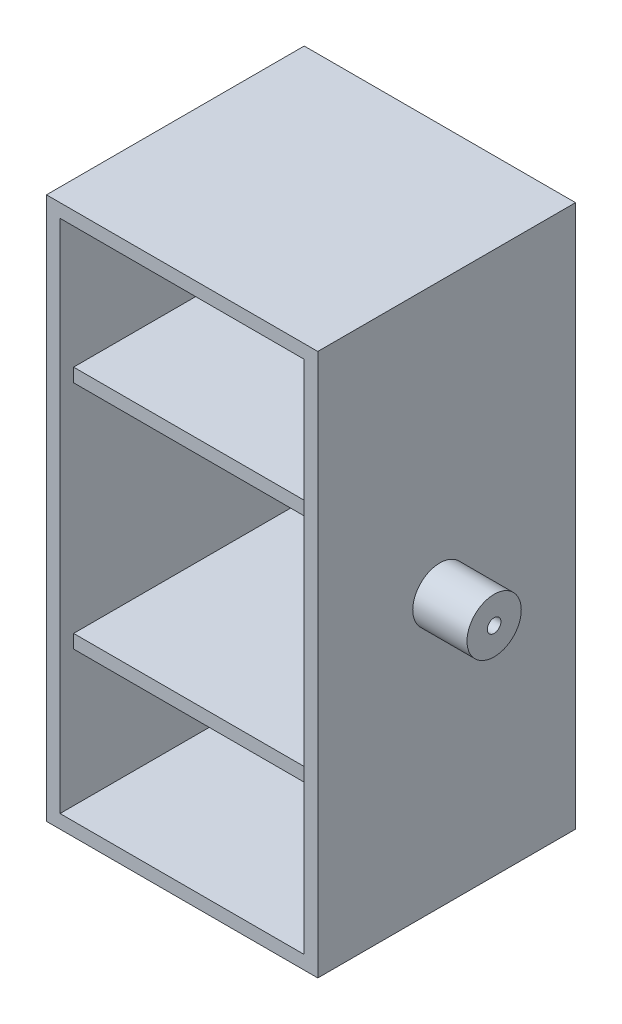
ISO-10303-21;
HEADER;
FILE_DESCRIPTION(('STEP AP214'),'2;1');
FILE_NAME('part.step','',(''),(''),'','','');
FILE_SCHEMA(('AUTOMOTIVE_DESIGN { 1 0 10303 214 1 1 1 1 }'));
ENDSEC;
DATA;
#1=APPLICATION_CONTEXT('core data for automotive mechanical design processes');
#2=APPLICATION_PROTOCOL_DEFINITION('international standard','automotive_design',2000,#1);
#3=PRODUCT_CONTEXT('',#1,'mechanical');
#4=PRODUCT('Part','Part','',(#3));
#5=PRODUCT_RELATED_PRODUCT_CATEGORY('part','',(#4));
#6=PRODUCT_DEFINITION_FORMATION('','',#4);
#7=PRODUCT_DEFINITION_CONTEXT('part definition',#1,'design');
#8=PRODUCT_DEFINITION('design','',#6,#7);
#9=PRODUCT_DEFINITION_SHAPE('','',#8);
#10=(LENGTH_UNIT() NAMED_UNIT(*) SI_UNIT(.MILLI.,.METRE.));
#11=(NAMED_UNIT(*) PLANE_ANGLE_UNIT() SI_UNIT($,.RADIAN.));
#12=(NAMED_UNIT(*) SI_UNIT($,.STERADIAN.) SOLID_ANGLE_UNIT());
#13=UNCERTAINTY_MEASURE_WITH_UNIT(LENGTH_MEASURE(1.E-05),#10,'distance_accuracy_value','');
#14=(GEOMETRIC_REPRESENTATION_CONTEXT(3) GLOBAL_UNCERTAINTY_ASSIGNED_CONTEXT((#13)) GLOBAL_UNIT_ASSIGNED_CONTEXT((#10,
#11,#12)) REPRESENTATION_CONTEXT('',''));
#15=CARTESIAN_POINT('',(0.,0.,0.));
#16=DIRECTION('',(0.,0.,1.));
#17=DIRECTION('',(1.,0.,0.));
#18=AXIS2_PLACEMENT_3D('',#15,#16,#17);
#19=CARTESIAN_POINT('',(0.,200.,0.));
#20=DIRECTION('',(1.,0.,0.));
#21=DIRECTION('',(0.,0.,-1.));
#22=AXIS2_PLACEMENT_3D('',#19,#20,#21);
#23=PLANE('',#22);
#24=CARTESIAN_POINT('',(0.,100.,50.));
#25=DIRECTION('',(1.,0.,0.));
#26=DIRECTION('',(0.,0.,-1.));
#27=AXIS2_PLACEMENT_3D('',#24,#25,#26);
#28=CIRCLE('',#27,10.);
#29=CARTESIAN_POINT('',(0.,100.,40.));
#30=VERTEX_POINT('',#29);
#31=EDGE_CURVE('E11',#30,#30,#28,.F.);
#32=ORIENTED_EDGE('',*,*,#31,.F.);
#33=EDGE_LOOP('',(#32));
#34=FACE_BOUND('',#33,.T.);
#35=DIRECTION('',(0.,-1.,0.));
#36=VECTOR('',#35,1.);
#37=CARTESIAN_POINT('',(0.,0.,95.));
#38=LINE('',#37,#36);
#39=CARTESIAN_POINT('',(0.,200.,95.));
#40=VERTEX_POINT('',#39);
#41=CARTESIAN_POINT('',(0.,0.,95.));
#42=VERTEX_POINT('',#41);
#43=EDGE_CURVE('E56',#40,#42,#38,.T.);
#44=ORIENTED_EDGE('',*,*,#43,.F.);
#45=DIRECTION('',(0.,0.,1.));
#46=VECTOR('',#45,1.);
#47=CARTESIAN_POINT('',(0.,200.,0.));
#48=LINE('',#47,#46);
#49=CARTESIAN_POINT('',(0.,200.,0.));
#50=VERTEX_POINT('',#49);
#51=EDGE_CURVE('E180',#50,#40,#48,.T.);
#52=ORIENTED_EDGE('',*,*,#51,.F.);
#53=DIRECTION('',(0.,-1.,0.));
#54=VECTOR('',#53,1.);
#55=CARTESIAN_POINT('',(0.,200.,0.));
#56=LINE('',#55,#54);
#57=CARTESIAN_POINT('',(0.,0.,0.));
#58=VERTEX_POINT('',#57);
#59=EDGE_CURVE('E186',#50,#58,#56,.T.);
#60=ORIENTED_EDGE('',*,*,#59,.T.);
#61=DIRECTION('',(0.,0.,1.));
#62=VECTOR('',#61,1.);
#63=CARTESIAN_POINT('',(0.,0.,0.));
#64=LINE('',#63,#62);
#65=EDGE_CURVE('E176',#58,#42,#64,.T.);
#66=ORIENTED_EDGE('',*,*,#65,.T.);
#67=EDGE_LOOP('',(#44,#52,#60,#66));
#68=FACE_BOUND('',#67,.T.);
#69=ADVANCED_FACE('F41',(#34,#68),#23,.F.);
#70=CARTESIAN_POINT('',(100.,200.,0.));
#71=DIRECTION('',(-1.,0.,0.));
#72=DIRECTION('',(0.,0.,1.));
#73=AXIS2_PLACEMENT_3D('',#70,#71,#72);
#74=PLANE('',#73);
#75=CARTESIAN_POINT('',(100.,100.,50.0000000000057));
#76=DIRECTION('',(-1.,0.,0.));
#77=DIRECTION('',(0.,0.,1.));
#78=AXIS2_PLACEMENT_3D('',#75,#76,#77);
#79=CIRCLE('',#78,10.);
#80=CARTESIAN_POINT('',(100.,100.,60.0000000000057));
#81=VERTEX_POINT('',#80);
#82=EDGE_CURVE('E49',#81,#81,#79,.F.);
#83=ORIENTED_EDGE('',*,*,#82,.F.);
#84=EDGE_LOOP('',(#83));
#85=FACE_BOUND('',#84,.T.);
#86=DIRECTION('',(0.,1.,0.));
#87=VECTOR('',#86,1.);
#88=CARTESIAN_POINT('',(100.,0.,95.));
#89=LINE('',#88,#87);
#90=CARTESIAN_POINT('',(100.,0.,95.));
#91=VERTEX_POINT('',#90);
#92=CARTESIAN_POINT('',(100.,200.,95.));
#93=VERTEX_POINT('',#92);
#94=EDGE_CURVE('E154',#91,#93,#89,.T.);
#95=ORIENTED_EDGE('',*,*,#94,.F.);
#96=DIRECTION('',(0.,0.,-1.));
#97=VECTOR('',#96,1.);
#98=CARTESIAN_POINT('',(100.,0.,0.));
#99=LINE('',#98,#97);
#100=CARTESIAN_POINT('',(100.,0.,0.));
#101=VERTEX_POINT('',#100);
#102=EDGE_CURVE('E166',#91,#101,#99,.T.);
#103=ORIENTED_EDGE('',*,*,#102,.T.);
#104=DIRECTION('',(0.,-1.,0.));
#105=VECTOR('',#104,1.);
#106=CARTESIAN_POINT('',(100.,200.,0.));
#107=LINE('',#106,#105);
#108=CARTESIAN_POINT('',(100.,200.,0.));
#109=VERTEX_POINT('',#108);
#110=EDGE_CURVE('E190',#109,#101,#107,.T.);
#111=ORIENTED_EDGE('',*,*,#110,.F.);
#112=DIRECTION('',(0.,0.,-1.));
#113=VECTOR('',#112,1.);
#114=CARTESIAN_POINT('',(100.,200.,0.));
#115=LINE('',#114,#113);
#116=EDGE_CURVE('E168',#93,#109,#115,.T.);
#117=ORIENTED_EDGE('',*,*,#116,.F.);
#118=EDGE_LOOP('',(#95,#103,#111,#117));
#119=FACE_BOUND('',#118,.T.);
#120=ADVANCED_FACE('F164',(#85,#119),#74,.F.);
#121=CARTESIAN_POINT('',(0.,200.,0.));
#122=DIRECTION('',(0.,1.,0.));
#123=DIRECTION('',(0.,0.,1.));
#124=AXIS2_PLACEMENT_3D('',#121,#122,#123);
#125=PLANE('',#124);
#126=ORIENTED_EDGE('',*,*,#51,.T.);
#127=DIRECTION('',(-1.,0.,0.));
#128=VECTOR('',#127,1.);
#129=CARTESIAN_POINT('',(0.,200.,95.));
#130=LINE('',#129,#128);
#131=EDGE_CURVE('E170',#93,#40,#130,.T.);
#132=ORIENTED_EDGE('',*,*,#131,.F.);
#133=ORIENTED_EDGE('',*,*,#116,.T.);
#134=DIRECTION('',(-1.,0.,0.));
#135=VECTOR('',#134,1.);
#136=CARTESIAN_POINT('',(0.,200.,0.));
#137=LINE('',#136,#135);
#138=EDGE_CURVE('E191',#109,#50,#137,.T.);
#139=ORIENTED_EDGE('',*,*,#138,.T.);
#140=EDGE_LOOP('',(#126,#132,#133,#139));
#141=FACE_BOUND('',#140,.T.);
#142=ADVANCED_FACE('F200',(#141),#125,.T.);
#143=CARTESIAN_POINT('',(0.,0.,0.));
#144=DIRECTION('',(0.,1.,0.));
#145=DIRECTION('',(0.,0.,1.));
#146=AXIS2_PLACEMENT_3D('',#143,#144,#145);
#147=PLANE('',#146);
#148=DIRECTION('',(1.,0.,0.));
#149=VECTOR('',#148,1.);
#150=CARTESIAN_POINT('',(0.,0.,95.));
#151=LINE('',#150,#149);
#152=EDGE_CURVE('E151',#42,#91,#151,.T.);
#153=ORIENTED_EDGE('',*,*,#152,.F.);
#154=ORIENTED_EDGE('',*,*,#65,.F.);
#155=DIRECTION('',(-1.,0.,0.));
#156=VECTOR('',#155,1.);
#157=CARTESIAN_POINT('',(0.,0.,0.));
#158=LINE('',#157,#156);
#159=EDGE_CURVE('E174',#101,#58,#158,.T.);
#160=ORIENTED_EDGE('',*,*,#159,.F.);
#161=ORIENTED_EDGE('',*,*,#102,.F.);
#162=EDGE_LOOP('',(#153,#154,#160,#161));
#163=FACE_BOUND('',#162,.T.);
#164=ADVANCED_FACE('F173',(#163),#147,.F.);
#165=CARTESIAN_POINT('',(0.,200.,0.));
#166=DIRECTION('',(0.,0.,1.));
#167=DIRECTION('',(1.,0.,0.));
#168=AXIS2_PLACEMENT_3D('',#165,#166,#167);
#169=PLANE('',#168);
#170=ORIENTED_EDGE('',*,*,#159,.T.);
#171=ORIENTED_EDGE('',*,*,#59,.F.);
#172=ORIENTED_EDGE('',*,*,#138,.F.);
#173=ORIENTED_EDGE('',*,*,#110,.T.);
#174=EDGE_LOOP('',(#170,#171,#172,#173));
#175=FACE_BOUND('',#174,.T.);
#176=ADVANCED_FACE('F353',(#175),#169,.F.);
#177=CARTESIAN_POINT('',(120.,100.,50.0000000000057));
#178=DIRECTION('',(1.,0.,0.));
#179=DIRECTION('',(0.,0.,-1.));
#180=AXIS2_PLACEMENT_3D('',#177,#178,#179);
#181=PLANE('',#180);
#182=CARTESIAN_POINT('',(120.,100.,50.0000000000057));
#183=DIRECTION('',(1.,0.,0.));
#184=DIRECTION('',(0.,0.,-1.));
#185=AXIS2_PLACEMENT_3D('',#182,#183,#184);
#186=CIRCLE('',#185,10.);
#187=CARTESIAN_POINT('',(120.,100.,40.0000000000057));
#188=VERTEX_POINT('',#187);
#189=EDGE_CURVE('E235',#188,#188,#186,.T.);
#190=ORIENTED_EDGE('',*,*,#189,.T.);
#191=EDGE_LOOP('',(#190));
#192=FACE_BOUND('',#191,.T.);
#193=CARTESIAN_POINT('',(120.,100.,50.0000000000057));
#194=DIRECTION('',(1.,0.,0.));
#195=DIRECTION('',(0.,0.,-1.));
#196=AXIS2_PLACEMENT_3D('',#193,#194,#195);
#197=CIRCLE('',#196,2.5);
#198=CARTESIAN_POINT('',(120.,100.,47.5000000000057));
#199=VERTEX_POINT('',#198);
#200=EDGE_CURVE('E229',#199,#199,#197,.T.);
#201=ORIENTED_EDGE('',*,*,#200,.F.);
#202=EDGE_LOOP('',(#201));
#203=FACE_BOUND('',#202,.T.);
#204=ADVANCED_FACE('F392',(#192,#203),#181,.T.);
#205=CARTESIAN_POINT('',(120.,100.,50.0000000000057));
#206=DIRECTION('',(-1.,0.,0.));
#207=DIRECTION('',(0.,0.,1.));
#208=AXIS2_PLACEMENT_3D('',#205,#206,#207);
#209=CYLINDRICAL_SURFACE('',#208,10.);
#210=ORIENTED_EDGE('',*,*,#189,.F.);
#211=EDGE_LOOP('',(#210));
#212=FACE_BOUND('',#211,.T.);
#213=ORIENTED_EDGE('',*,*,#82,.T.);
#214=EDGE_LOOP('',(#213));
#215=FACE_BOUND('',#214,.T.);
#216=ADVANCED_FACE('F197',(#212,#215),#209,.T.);
#217=CARTESIAN_POINT('',(120.,100.,50.0000000000057));
#218=DIRECTION('',(-1.,0.,0.));
#219=DIRECTION('',(0.,0.,1.));
#220=AXIS2_PLACEMENT_3D('',#217,#218,#219);
#221=CYLINDRICAL_SURFACE('',#220,2.5);
#222=ORIENTED_EDGE('',*,*,#200,.T.);
#223=EDGE_LOOP('',(#222));
#224=FACE_BOUND('',#223,.T.);
#225=CARTESIAN_POINT('',(100.,100.,50.0000000000057));
#226=DIRECTION('',(1.,0.,0.));
#227=DIRECTION('',(0.,0.,-1.));
#228=AXIS2_PLACEMENT_3D('',#225,#226,#227);
#229=CIRCLE('',#228,2.5);
#230=CARTESIAN_POINT('',(100.,100.,47.5000000000057));
#231=VERTEX_POINT('',#230);
#232=EDGE_CURVE('E226',#231,#231,#229,.T.);
#233=ORIENTED_EDGE('',*,*,#232,.F.);
#234=EDGE_LOOP('',(#233));
#235=FACE_BOUND('',#234,.T.);
#236=ADVANCED_FACE('F213',(#224,#235),#221,.F.);
#237=ORIENTED_EDGE('',*,*,#232,.T.);
#238=EDGE_LOOP('',(#237));
#239=FACE_BOUND('',#238,.T.);
#240=ADVANCED_FACE('F201',(#239),#74,.F.);
#241=CARTESIAN_POINT('',(-20.,100.,50.));
#242=DIRECTION('',(-1.,0.,0.));
#243=DIRECTION('',(0.,0.,1.));
#244=AXIS2_PLACEMENT_3D('',#241,#242,#243);
#245=PLANE('',#244);
#246=CARTESIAN_POINT('',(-20.,100.,50.));
#247=DIRECTION('',(-1.,0.,0.));
#248=DIRECTION('',(0.,0.,1.));
#249=AXIS2_PLACEMENT_3D('',#246,#247,#248);
#250=CIRCLE('',#249,10.);
#251=CARTESIAN_POINT('',(-20.,100.,60.));
#252=VERTEX_POINT('',#251);
#253=EDGE_CURVE('E230',#252,#252,#250,.T.);
#254=ORIENTED_EDGE('',*,*,#253,.T.);
#255=EDGE_LOOP('',(#254));
#256=FACE_BOUND('',#255,.T.);
#257=CARTESIAN_POINT('',(-20.,100.,50.));
#258=DIRECTION('',(-1.,0.,0.));
#259=DIRECTION('',(0.,0.,1.));
#260=AXIS2_PLACEMENT_3D('',#257,#258,#259);
#261=CIRCLE('',#260,2.5);
#262=CARTESIAN_POINT('',(-20.,100.,52.5));
#263=VERTEX_POINT('',#262);
#264=EDGE_CURVE('E238',#263,#263,#261,.T.);
#265=ORIENTED_EDGE('',*,*,#264,.F.);
#266=EDGE_LOOP('',(#265));
#267=FACE_BOUND('',#266,.T.);
#268=ADVANCED_FACE('F212',(#256,#267),#245,.T.);
#269=CARTESIAN_POINT('',(-20.,100.,50.));
#270=DIRECTION('',(1.,0.,0.));
#271=DIRECTION('',(0.,0.,-1.));
#272=AXIS2_PLACEMENT_3D('',#269,#270,#271);
#273=CYLINDRICAL_SURFACE('',#272,10.);
#274=ORIENTED_EDGE('',*,*,#253,.F.);
#275=EDGE_LOOP('',(#274));
#276=FACE_BOUND('',#275,.T.);
#277=ORIENTED_EDGE('',*,*,#31,.T.);
#278=EDGE_LOOP('',(#277));
#279=FACE_BOUND('',#278,.T.);
#280=ADVANCED_FACE('F219',(#276,#279),#273,.T.);
#281=CARTESIAN_POINT('',(-20.,100.,50.));
#282=DIRECTION('',(1.,0.,0.));
#283=DIRECTION('',(0.,0.,-1.));
#284=AXIS2_PLACEMENT_3D('',#281,#282,#283);
#285=CYLINDRICAL_SURFACE('',#284,2.5);
#286=ORIENTED_EDGE('',*,*,#264,.T.);
#287=EDGE_LOOP('',(#286));
#288=FACE_BOUND('',#287,.T.);
#289=CARTESIAN_POINT('',(0.,100.,50.));
#290=DIRECTION('',(-1.,0.,0.));
#291=DIRECTION('',(0.,0.,1.));
#292=AXIS2_PLACEMENT_3D('',#289,#290,#291);
#293=CIRCLE('',#292,2.5);
#294=CARTESIAN_POINT('',(0.,100.,52.5));
#295=VERTEX_POINT('',#294);
#296=EDGE_CURVE('E371',#295,#295,#293,.T.);
#297=ORIENTED_EDGE('',*,*,#296,.F.);
#298=EDGE_LOOP('',(#297));
#299=FACE_BOUND('',#298,.T.);
#300=ADVANCED_FACE('F380',(#288,#299),#285,.F.);
#301=ORIENTED_EDGE('',*,*,#296,.T.);
#302=EDGE_LOOP('',(#301));
#303=FACE_BOUND('',#302,.T.);
#304=ADVANCED_FACE('F209',(#303),#23,.F.);
#305=CARTESIAN_POINT('',(0.,0.,95.));
#306=DIRECTION('',(0.,0.,1.));
#307=DIRECTION('',(1.,0.,0.));
#308=AXIS2_PLACEMENT_3D('',#305,#306,#307);
#309=PLANE('',#308);
#310=ORIENTED_EDGE('',*,*,#152,.T.);
#311=ORIENTED_EDGE('',*,*,#94,.T.);
#312=ORIENTED_EDGE('',*,*,#131,.T.);
#313=ORIENTED_EDGE('',*,*,#43,.T.);
#314=EDGE_LOOP('',(#310,#311,#312,#313));
#315=FACE_BOUND('',#314,.T.);
#316=DIRECTION('',(1.,0.,0.));
#317=VECTOR('',#316,1.);
#318=CARTESIAN_POINT('',(0.,195.,95.));
#319=LINE('',#318,#317);
#320=CARTESIAN_POINT('',(5.,195.,95.));
#321=VERTEX_POINT('',#320);
#322=CARTESIAN_POINT('',(95.,195.,95.));
#323=VERTEX_POINT('',#322);
#324=EDGE_CURVE('E356',#321,#323,#319,.T.);
#325=ORIENTED_EDGE('',*,*,#324,.T.);
#326=DIRECTION('',(0.,-1.,0.));
#327=VECTOR('',#326,1.);
#328=CARTESIAN_POINT('',(95.,0.,95.));
#329=LINE('',#328,#327);
#330=CARTESIAN_POINT('',(95.,5.,95.));
#331=VERTEX_POINT('',#330);
#332=EDGE_CURVE('E64',#323,#331,#329,.T.);
#333=ORIENTED_EDGE('',*,*,#332,.T.);
#334=DIRECTION('',(-1.,0.,0.));
#335=VECTOR('',#334,1.);
#336=CARTESIAN_POINT('',(0.,5.,95.));
#337=LINE('',#336,#335);
#338=CARTESIAN_POINT('',(5.,5.,95.));
#339=VERTEX_POINT('',#338);
#340=EDGE_CURVE('E365',#331,#339,#337,.T.);
#341=ORIENTED_EDGE('',*,*,#340,.T.);
#342=DIRECTION('',(0.,1.,0.));
#343=VECTOR('',#342,1.);
#344=CARTESIAN_POINT('',(5.,0.,95.));
#345=LINE('',#344,#343);
#346=EDGE_CURVE('E368',#339,#321,#345,.T.);
#347=ORIENTED_EDGE('',*,*,#346,.T.);
#348=EDGE_LOOP('',(#325,#333,#341,#347));
#349=FACE_BOUND('',#348,.T.);
#350=ADVANCED_FACE('F153',(#315,#349),#309,.T.);
#351=CARTESIAN_POINT('',(5.,55.,90.));
#352=DIRECTION('',(0.,1.,0.));
#353=DIRECTION('',(-1.,0.,0.));
#354=AXIS2_PLACEMENT_3D('',#351,#352,#353);
#355=PLANE('',#354);
#356=DIRECTION('',(1.,0.,0.));
#357=VECTOR('',#356,1.);
#358=CARTESIAN_POINT('',(5.,55.,5.));
#359=LINE('',#358,#357);
#360=CARTESIAN_POINT('',(5.,55.,5.));
#361=VERTEX_POINT('',#360);
#362=CARTESIAN_POINT('',(95.,55.,5.));
#363=VERTEX_POINT('',#362);
#364=EDGE_CURVE('E277',#361,#363,#359,.T.);
#365=ORIENTED_EDGE('',*,*,#364,.T.);
#366=DIRECTION('',(0.,0.,-1.));
#367=VECTOR('',#366,1.);
#368=CARTESIAN_POINT('',(95.,55.,90.));
#369=LINE('',#368,#367);
#370=CARTESIAN_POINT('',(95.,55.,90.));
#371=VERTEX_POINT('',#370);
#372=EDGE_CURVE('E305',#371,#363,#369,.T.);
#373=ORIENTED_EDGE('',*,*,#372,.F.);
#374=DIRECTION('',(1.,0.,0.));
#375=VECTOR('',#374,1.);
#376=CARTESIAN_POINT('',(5.,55.,90.));
#377=LINE('',#376,#375);
#378=CARTESIAN_POINT('',(5.,55.,90.));
#379=VERTEX_POINT('',#378);
#380=EDGE_CURVE('E282',#379,#371,#377,.T.);
#381=ORIENTED_EDGE('',*,*,#380,.F.);
#382=DIRECTION('',(0.,0.,-1.));
#383=VECTOR('',#382,1.);
#384=CARTESIAN_POINT('',(5.,55.,90.));
#385=LINE('',#384,#383);
#386=EDGE_CURVE('E309',#379,#361,#385,.T.);
#387=ORIENTED_EDGE('',*,*,#386,.T.);
#388=EDGE_LOOP('',(#365,#373,#381,#387));
#389=FACE_BOUND('',#388,.T.);
#390=ADVANCED_FACE('F417',(#389),#355,.F.);
#391=CARTESIAN_POINT('',(0.,0.,90.));
#392=DIRECTION('',(0.,0.,-1.));
#393=DIRECTION('',(-1.,0.,0.));
#394=AXIS2_PLACEMENT_3D('',#391,#392,#393);
#395=PLANE('',#394);
#396=DIRECTION('',(0.,-1.,0.));
#397=VECTOR('',#396,1.);
#398=CARTESIAN_POINT('',(5.,55.,90.));
#399=LINE('',#398,#397);
#400=CARTESIAN_POINT('',(5.,60.,90.));
#401=VERTEX_POINT('',#400);
#402=EDGE_CURVE('E278',#401,#379,#399,.T.);
#403=ORIENTED_EDGE('',*,*,#402,.T.);
#404=ORIENTED_EDGE('',*,*,#380,.T.);
#405=DIRECTION('',(0.,1.,0.));
#406=VECTOR('',#405,1.);
#407=CARTESIAN_POINT('',(95.,55.,90.));
#408=LINE('',#407,#406);
#409=CARTESIAN_POINT('',(95.,60.,90.));
#410=VERTEX_POINT('',#409);
#411=EDGE_CURVE('E286',#371,#410,#408,.T.);
#412=ORIENTED_EDGE('',*,*,#411,.T.);
#413=DIRECTION('',(-1.,0.,0.));
#414=VECTOR('',#413,1.);
#415=CARTESIAN_POINT('',(5.,60.,90.));
#416=LINE('',#415,#414);
#417=EDGE_CURVE('E289',#410,#401,#416,.T.);
#418=ORIENTED_EDGE('',*,*,#417,.T.);
#419=EDGE_LOOP('',(#403,#404,#412,#418));
#420=FACE_BOUND('',#419,.T.);
#421=ADVANCED_FACE('F413',(#420),#395,.F.);
#422=CARTESIAN_POINT('',(5.,60.,90.));
#423=DIRECTION('',(0.,-1.,0.));
#424=DIRECTION('',(0.,0.,-1.));
#425=AXIS2_PLACEMENT_3D('',#422,#423,#424);
#426=PLANE('',#425);
#427=DIRECTION('',(-1.,0.,0.));
#428=VECTOR('',#427,1.);
#429=CARTESIAN_POINT('',(5.,60.,5.));
#430=LINE('',#429,#428);
#431=CARTESIAN_POINT('',(95.,60.,5.));
#432=VERTEX_POINT('',#431);
#433=CARTESIAN_POINT('',(5.,60.,5.));
#434=VERTEX_POINT('',#433);
#435=EDGE_CURVE('E283',#432,#434,#430,.T.);
#436=ORIENTED_EDGE('',*,*,#435,.T.);
#437=DIRECTION('',(0.,0.,-1.));
#438=VECTOR('',#437,1.);
#439=CARTESIAN_POINT('',(5.,60.,90.));
#440=LINE('',#439,#438);
#441=EDGE_CURVE('E292',#401,#434,#440,.T.);
#442=ORIENTED_EDGE('',*,*,#441,.F.);
#443=ORIENTED_EDGE('',*,*,#417,.F.);
#444=DIRECTION('',(0.,0.,-1.));
#445=VECTOR('',#444,1.);
#446=CARTESIAN_POINT('',(95.,60.,90.));
#447=LINE('',#446,#445);
#448=EDGE_CURVE('E301',#410,#432,#447,.T.);
#449=ORIENTED_EDGE('',*,*,#448,.T.);
#450=EDGE_LOOP('',(#436,#442,#443,#449));
#451=FACE_BOUND('',#450,.T.);
#452=ADVANCED_FACE('F416',(#451),#426,.F.);
#453=CARTESIAN_POINT('',(0.,200.,5.));
#454=DIRECTION('',(0.,0.,1.));
#455=DIRECTION('',(1.,0.,0.));
#456=AXIS2_PLACEMENT_3D('',#453,#454,#455);
#457=PLANE('',#456);
#458=DIRECTION('',(0.,-1.,0.));
#459=VECTOR('',#458,1.);
#460=CARTESIAN_POINT('',(95.,200.,5.));
#461=LINE('',#460,#459);
#462=CARTESIAN_POINT('',(95.,140.,5.));
#463=VERTEX_POINT('',#462);
#464=EDGE_CURVE('E339',#463,#432,#461,.T.);
#465=ORIENTED_EDGE('',*,*,#464,.F.);
#466=DIRECTION('',(1.,0.,0.));
#467=VECTOR('',#466,1.);
#468=CARTESIAN_POINT('',(5.,140.,5.));
#469=LINE('',#468,#467);
#470=CARTESIAN_POINT('',(5.,140.,5.));
#471=VERTEX_POINT('',#470);
#472=EDGE_CURVE('E244',#471,#463,#469,.T.);
#473=ORIENTED_EDGE('',*,*,#472,.F.);
#474=DIRECTION('',(0.,-1.,0.));
#475=VECTOR('',#474,1.);
#476=CARTESIAN_POINT('',(5.,200.,5.));
#477=LINE('',#476,#475);
#478=EDGE_CURVE('E328',#471,#434,#477,.T.);
#479=ORIENTED_EDGE('',*,*,#478,.T.);
#480=ORIENTED_EDGE('',*,*,#435,.F.);
#481=EDGE_LOOP('',(#465,#473,#479,#480));
#482=FACE_BOUND('',#481,.T.);
#483=ADVANCED_FACE('F411',(#482),#457,.T.);
#484=CARTESIAN_POINT('',(5.,140.,90.));
#485=DIRECTION('',(0.,1.,0.));
#486=DIRECTION('',(0.,0.,1.));
#487=AXIS2_PLACEMENT_3D('',#484,#485,#486);
#488=PLANE('',#487);
#489=ORIENTED_EDGE('',*,*,#472,.T.);
#490=DIRECTION('',(0.,0.,-1.));
#491=VECTOR('',#490,1.);
#492=CARTESIAN_POINT('',(95.,140.,90.));
#493=LINE('',#492,#491);
#494=CARTESIAN_POINT('',(95.,140.,90.));
#495=VERTEX_POINT('',#494);
#496=EDGE_CURVE('E270',#495,#463,#493,.T.);
#497=ORIENTED_EDGE('',*,*,#496,.F.);
#498=DIRECTION('',(1.,0.,0.));
#499=VECTOR('',#498,1.);
#500=CARTESIAN_POINT('',(5.,140.,90.));
#501=LINE('',#500,#499);
#502=CARTESIAN_POINT('',(5.,140.,90.));
#503=VERTEX_POINT('',#502);
#504=EDGE_CURVE('E249',#503,#495,#501,.T.);
#505=ORIENTED_EDGE('',*,*,#504,.F.);
#506=DIRECTION('',(0.,0.,-1.));
#507=VECTOR('',#506,1.);
#508=CARTESIAN_POINT('',(5.,140.,90.));
#509=LINE('',#508,#507);
#510=EDGE_CURVE('E274',#503,#471,#509,.T.);
#511=ORIENTED_EDGE('',*,*,#510,.T.);
#512=EDGE_LOOP('',(#489,#497,#505,#511));
#513=FACE_BOUND('',#512,.T.);
#514=ADVANCED_FACE('F403',(#513),#488,.F.);
#515=CARTESIAN_POINT('',(0.,0.,90.));
#516=DIRECTION('',(0.,0.,1.));
#517=DIRECTION('',(1.,0.,0.));
#518=AXIS2_PLACEMENT_3D('',#515,#516,#517);
#519=PLANE('',#518);
#520=DIRECTION('',(0.,-1.,0.));
#521=VECTOR('',#520,1.);
#522=CARTESIAN_POINT('',(5.,145.,90.));
#523=LINE('',#522,#521);
#524=CARTESIAN_POINT('',(5.,145.,90.));
#525=VERTEX_POINT('',#524);
#526=EDGE_CURVE('E245',#525,#503,#523,.T.);
#527=ORIENTED_EDGE('',*,*,#526,.T.);
#528=ORIENTED_EDGE('',*,*,#504,.T.);
#529=DIRECTION('',(0.,1.,0.));
#530=VECTOR('',#529,1.);
#531=CARTESIAN_POINT('',(95.,145.,90.));
#532=LINE('',#531,#530);
#533=CARTESIAN_POINT('',(95.,145.,90.));
#534=VERTEX_POINT('',#533);
#535=EDGE_CURVE('E253',#495,#534,#532,.T.);
#536=ORIENTED_EDGE('',*,*,#535,.T.);
#537=DIRECTION('',(-1.,0.,0.));
#538=VECTOR('',#537,1.);
#539=CARTESIAN_POINT('',(5.,145.,90.));
#540=LINE('',#539,#538);
#541=EDGE_CURVE('E256',#534,#525,#540,.T.);
#542=ORIENTED_EDGE('',*,*,#541,.T.);
#543=EDGE_LOOP('',(#527,#528,#536,#542));
#544=FACE_BOUND('',#543,.T.);
#545=ADVANCED_FACE('F399',(#544),#519,.T.);
#546=CARTESIAN_POINT('',(5.,145.,90.));
#547=DIRECTION('',(0.,-1.,0.));
#548=DIRECTION('',(0.,0.,-1.));
#549=AXIS2_PLACEMENT_3D('',#546,#547,#548);
#550=PLANE('',#549);
#551=DIRECTION('',(-1.,0.,0.));
#552=VECTOR('',#551,1.);
#553=CARTESIAN_POINT('',(5.,145.,5.));
#554=LINE('',#553,#552);
#555=CARTESIAN_POINT('',(95.,145.,5.));
#556=VERTEX_POINT('',#555);
#557=CARTESIAN_POINT('',(5.,145.,5.));
#558=VERTEX_POINT('',#557);
#559=EDGE_CURVE('E250',#556,#558,#554,.T.);
#560=ORIENTED_EDGE('',*,*,#559,.T.);
#561=DIRECTION('',(0.,0.,-1.));
#562=VECTOR('',#561,1.);
#563=CARTESIAN_POINT('',(5.,145.,90.));
#564=LINE('',#563,#562);
#565=EDGE_CURVE('E259',#525,#558,#564,.T.);
#566=ORIENTED_EDGE('',*,*,#565,.F.);
#567=ORIENTED_EDGE('',*,*,#541,.F.);
#568=DIRECTION('',(0.,0.,-1.));
#569=VECTOR('',#568,1.);
#570=CARTESIAN_POINT('',(95.,145.,90.));
#571=LINE('',#570,#569);
#572=EDGE_CURVE('E267',#534,#556,#571,.T.);
#573=ORIENTED_EDGE('',*,*,#572,.T.);
#574=EDGE_LOOP('',(#560,#566,#567,#573));
#575=FACE_BOUND('',#574,.T.);
#576=ADVANCED_FACE('F402',(#575),#550,.F.);
#577=CARTESIAN_POINT('',(5.,195.,5.));
#578=VERTEX_POINT('',#577);
#579=EDGE_CURVE('E323',#578,#558,#477,.T.);
#580=ORIENTED_EDGE('',*,*,#579,.T.);
#581=ORIENTED_EDGE('',*,*,#559,.F.);
#582=CARTESIAN_POINT('',(95.,195.,5.));
#583=VERTEX_POINT('',#582);
#584=EDGE_CURVE('E182',#583,#556,#461,.T.);
#585=ORIENTED_EDGE('',*,*,#584,.F.);
#586=DIRECTION('',(-1.,0.,0.));
#587=VECTOR('',#586,1.);
#588=CARTESIAN_POINT('',(0.,195.,5.));
#589=LINE('',#588,#587);
#590=EDGE_CURVE('E333',#583,#578,#589,.T.);
#591=ORIENTED_EDGE('',*,*,#590,.T.);
#592=EDGE_LOOP('',(#580,#581,#585,#591));
#593=FACE_BOUND('',#592,.T.);
#594=ADVANCED_FACE('F407',(#593),#457,.T.);
#595=CARTESIAN_POINT('',(95.,5.,5.));
#596=VERTEX_POINT('',#595);
#597=EDGE_CURVE('E327',#363,#596,#461,.T.);
#598=ORIENTED_EDGE('',*,*,#597,.F.);
#599=ORIENTED_EDGE('',*,*,#364,.F.);
#600=CARTESIAN_POINT('',(5.,5.,5.));
#601=VERTEX_POINT('',#600);
#602=EDGE_CURVE('E329',#361,#601,#477,.T.);
#603=ORIENTED_EDGE('',*,*,#602,.T.);
#604=DIRECTION('',(-1.,0.,0.));
#605=VECTOR('',#604,1.);
#606=CARTESIAN_POINT('',(0.,5.,5.));
#607=LINE('',#606,#605);
#608=EDGE_CURVE('E322',#596,#601,#607,.T.);
#609=ORIENTED_EDGE('',*,*,#608,.F.);
#610=EDGE_LOOP('',(#598,#599,#603,#609));
#611=FACE_BOUND('',#610,.T.);
#612=ADVANCED_FACE('F434',(#611),#457,.T.);
#613=CARTESIAN_POINT('',(0.,195.,0.));
#614=DIRECTION('',(0.,1.,0.));
#615=DIRECTION('',(0.,0.,1.));
#616=AXIS2_PLACEMENT_3D('',#613,#614,#615);
#617=PLANE('',#616);
#618=ORIENTED_EDGE('',*,*,#324,.F.);
#619=DIRECTION('',(0.,0.,1.));
#620=VECTOR('',#619,1.);
#621=CARTESIAN_POINT('',(5.,195.,0.));
#622=LINE('',#621,#620);
#623=EDGE_CURVE('E317',#578,#321,#622,.T.);
#624=ORIENTED_EDGE('',*,*,#623,.F.);
#625=ORIENTED_EDGE('',*,*,#590,.F.);
#626=DIRECTION('',(0.,0.,-1.));
#627=VECTOR('',#626,1.);
#628=CARTESIAN_POINT('',(95.,195.,0.));
#629=LINE('',#628,#627);
#630=EDGE_CURVE('E321',#323,#583,#629,.T.);
#631=ORIENTED_EDGE('',*,*,#630,.F.);
#632=EDGE_LOOP('',(#618,#624,#625,#631));
#633=FACE_BOUND('',#632,.T.);
#634=ADVANCED_FACE('F437',(#633),#617,.F.);
#635=CARTESIAN_POINT('',(0.,5.,0.));
#636=DIRECTION('',(0.,1.,0.));
#637=DIRECTION('',(0.,0.,1.));
#638=AXIS2_PLACEMENT_3D('',#635,#636,#637);
#639=PLANE('',#638);
#640=DIRECTION('',(0.,0.,1.));
#641=VECTOR('',#640,1.);
#642=CARTESIAN_POINT('',(5.,5.,0.));
#643=LINE('',#642,#641);
#644=EDGE_CURVE('E312',#601,#339,#643,.T.);
#645=ORIENTED_EDGE('',*,*,#644,.T.);
#646=ORIENTED_EDGE('',*,*,#340,.F.);
#647=DIRECTION('',(0.,0.,-1.));
#648=VECTOR('',#647,1.);
#649=CARTESIAN_POINT('',(95.,5.,0.));
#650=LINE('',#649,#648);
#651=EDGE_CURVE('E316',#331,#596,#650,.T.);
#652=ORIENTED_EDGE('',*,*,#651,.T.);
#653=ORIENTED_EDGE('',*,*,#608,.T.);
#654=EDGE_LOOP('',(#645,#646,#652,#653));
#655=FACE_BOUND('',#654,.T.);
#656=ADVANCED_FACE('F432',(#655),#639,.T.);
#657=CARTESIAN_POINT('',(95.,200.,0.));
#658=DIRECTION('',(-1.,0.,0.));
#659=DIRECTION('',(0.,0.,1.));
#660=AXIS2_PLACEMENT_3D('',#657,#658,#659);
#661=PLANE('',#660);
#662=ORIENTED_EDGE('',*,*,#651,.F.);
#663=ORIENTED_EDGE('',*,*,#332,.F.);
#664=ORIENTED_EDGE('',*,*,#630,.T.);
#665=ORIENTED_EDGE('',*,*,#584,.T.);
#666=ORIENTED_EDGE('',*,*,#572,.F.);
#667=ORIENTED_EDGE('',*,*,#535,.F.);
#668=ORIENTED_EDGE('',*,*,#496,.T.);
#669=ORIENTED_EDGE('',*,*,#464,.T.);
#670=ORIENTED_EDGE('',*,*,#448,.F.);
#671=ORIENTED_EDGE('',*,*,#411,.F.);
#672=ORIENTED_EDGE('',*,*,#372,.T.);
#673=ORIENTED_EDGE('',*,*,#597,.T.);
#674=EDGE_LOOP('',(#662,#663,#664,#665,#666,#667,#668,#669,#670,#671,#672,#673));
#675=FACE_BOUND('',#674,.T.);
#676=ADVANCED_FACE('F428',(#675),#661,.T.);
#677=CARTESIAN_POINT('',(5.,200.,0.));
#678=DIRECTION('',(1.,0.,0.));
#679=DIRECTION('',(0.,0.,-1.));
#680=AXIS2_PLACEMENT_3D('',#677,#678,#679);
#681=PLANE('',#680);
#682=ORIENTED_EDGE('',*,*,#623,.T.);
#683=ORIENTED_EDGE('',*,*,#346,.F.);
#684=ORIENTED_EDGE('',*,*,#644,.F.);
#685=ORIENTED_EDGE('',*,*,#602,.F.);
#686=ORIENTED_EDGE('',*,*,#386,.F.);
#687=ORIENTED_EDGE('',*,*,#402,.F.);
#688=ORIENTED_EDGE('',*,*,#441,.T.);
#689=ORIENTED_EDGE('',*,*,#478,.F.);
#690=ORIENTED_EDGE('',*,*,#510,.F.);
#691=ORIENTED_EDGE('',*,*,#526,.F.);
#692=ORIENTED_EDGE('',*,*,#565,.T.);
#693=ORIENTED_EDGE('',*,*,#579,.F.);
#694=EDGE_LOOP('',(#682,#683,#684,#685,#686,#687,#688,#689,#690,#691,#692,#693));
#695=FACE_BOUND('',#694,.T.);
#696=ADVANCED_FACE('F425',(#695),#681,.T.);
#697=CLOSED_SHELL('',(#69,#120,#142,#164,#176,#204,#216,#236,#240,#268,#280,#300,#304,#350,#390,
#421,#452,#483,#514,#545,#576,#594,#612,#634,#656,#676,#696));
#698=MANIFOLD_SOLID_BREP('B2',#697);
#699=ADVANCED_BREP_SHAPE_REPRESENTATION('',(#18,#698),#14);
#700=SHAPE_DEFINITION_REPRESENTATION(#9,#699);
ENDSEC;
END-ISO-10303-21;
